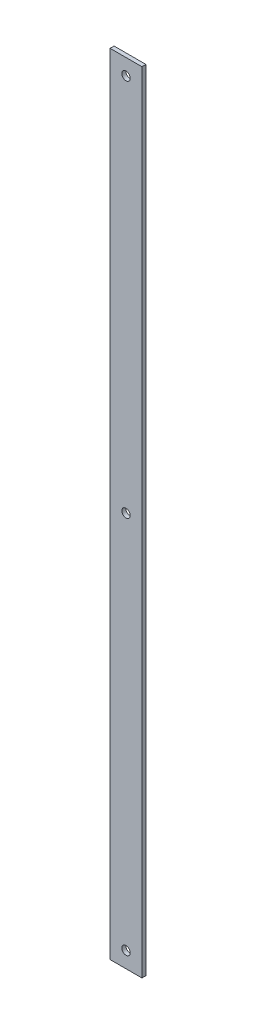
ISO-10303-21;
HEADER;
FILE_DESCRIPTION(('STEP AP214'),'2;1');
FILE_NAME('part.step','',(''),(''),'','','');
FILE_SCHEMA(('AUTOMOTIVE_DESIGN { 1 0 10303 214 1 1 1 1 }'));
ENDSEC;
DATA;
#1=APPLICATION_CONTEXT('core data for automotive mechanical design processes');
#2=APPLICATION_PROTOCOL_DEFINITION('international standard','automotive_design',2000,#1);
#3=PRODUCT_CONTEXT('',#1,'mechanical');
#4=PRODUCT('Part','Part','',(#3));
#5=PRODUCT_RELATED_PRODUCT_CATEGORY('part','',(#4));
#6=PRODUCT_DEFINITION_FORMATION('','',#4);
#7=PRODUCT_DEFINITION_CONTEXT('part definition',#1,'design');
#8=PRODUCT_DEFINITION('design','',#6,#7);
#9=PRODUCT_DEFINITION_SHAPE('','',#8);
#10=(LENGTH_UNIT() NAMED_UNIT(*) SI_UNIT(.MILLI.,.METRE.));
#11=(NAMED_UNIT(*) PLANE_ANGLE_UNIT() SI_UNIT($,.RADIAN.));
#12=(NAMED_UNIT(*) SI_UNIT($,.STERADIAN.) SOLID_ANGLE_UNIT());
#13=UNCERTAINTY_MEASURE_WITH_UNIT(LENGTH_MEASURE(1.E-05),#10,'distance_accuracy_value','');
#14=(GEOMETRIC_REPRESENTATION_CONTEXT(3) GLOBAL_UNCERTAINTY_ASSIGNED_CONTEXT((#13)) GLOBAL_UNIT_ASSIGNED_CONTEXT((#10,
#11,#12)) REPRESENTATION_CONTEXT('',''));
#15=CARTESIAN_POINT('',(0.,0.,0.));
#16=DIRECTION('',(0.,0.,1.));
#17=DIRECTION('',(1.,0.,0.));
#18=AXIS2_PLACEMENT_3D('',#15,#16,#17);
#19=CARTESIAN_POINT('',(-12.7,615.95,0.));
#20=DIRECTION('',(0.,0.,1.));
#21=DIRECTION('',(1.,0.,0.));
#22=AXIS2_PLACEMENT_3D('',#19,#20,#21);
#23=CYLINDRICAL_SURFACE('',#22,3.3655);
#24=CARTESIAN_POINT('',(-12.7,615.95,0.));
#25=DIRECTION('',(0.,0.,1.));
#26=DIRECTION('',(1.,0.,0.));
#27=AXIS2_PLACEMENT_3D('',#24,#25,#26);
#28=CIRCLE('',#27,3.3655);
#29=CARTESIAN_POINT('',(-9.33449999999996,615.95,0.));
#30=VERTEX_POINT('',#29);
#31=EDGE_CURVE('E45',#30,#30,#28,.T.);
#32=ORIENTED_EDGE('',*,*,#31,.F.);
#33=EDGE_LOOP('',(#32));
#34=FACE_BOUND('',#33,.T.);
#35=CARTESIAN_POINT('',(-12.7,615.95,3.175));
#36=DIRECTION('',(0.,0.,1.));
#37=DIRECTION('',(1.,0.,0.));
#38=AXIS2_PLACEMENT_3D('',#35,#36,#37);
#39=CIRCLE('',#38,3.3655);
#40=CARTESIAN_POINT('',(-9.33449999999996,615.95,3.175));
#41=VERTEX_POINT('',#40);
#42=EDGE_CURVE('E11',#41,#41,#39,.T.);
#43=ORIENTED_EDGE('',*,*,#42,.T.);
#44=EDGE_LOOP('',(#43));
#45=FACE_BOUND('',#44,.T.);
#46=ADVANCED_FACE('F37',(#34,#45),#23,.F.);
#47=CARTESIAN_POINT('',(0.,0.,3.175));
#48=DIRECTION('',(-1.,0.,0.));
#49=DIRECTION('',(0.,-1.,0.));
#50=AXIS2_PLACEMENT_3D('',#47,#48,#49);
#51=PLANE('',#50);
#52=DIRECTION('',(0.,1.,0.));
#53=VECTOR('',#52,1.);
#54=CARTESIAN_POINT('',(0.,0.,0.));
#55=LINE('',#54,#53);
#56=CARTESIAN_POINT('',(0.,0.,0.));
#57=VERTEX_POINT('',#56);
#58=CARTESIAN_POINT('',(0.,628.65,0.));
#59=VERTEX_POINT('',#58);
#60=EDGE_CURVE('E105',#57,#59,#55,.T.);
#61=ORIENTED_EDGE('',*,*,#60,.T.);
#62=DIRECTION('',(0.,0.,-1.));
#63=VECTOR('',#62,1.);
#64=CARTESIAN_POINT('',(0.,628.65,3.175));
#65=LINE('',#64,#63);
#66=CARTESIAN_POINT('',(0.,628.65,3.175));
#67=VERTEX_POINT('',#66);
#68=EDGE_CURVE('E96',#67,#59,#65,.T.);
#69=ORIENTED_EDGE('',*,*,#68,.F.);
#70=DIRECTION('',(0.,1.,0.));
#71=VECTOR('',#70,1.);
#72=CARTESIAN_POINT('',(0.,0.,3.175));
#73=LINE('',#72,#71);
#74=CARTESIAN_POINT('',(0.,0.,3.175));
#75=VERTEX_POINT('',#74);
#76=EDGE_CURVE('E90',#75,#67,#73,.T.);
#77=ORIENTED_EDGE('',*,*,#76,.F.);
#78=DIRECTION('',(0.,0.,-1.));
#79=VECTOR('',#78,1.);
#80=CARTESIAN_POINT('',(0.,0.,3.175));
#81=LINE('',#80,#79);
#82=EDGE_CURVE('E101',#75,#57,#81,.T.);
#83=ORIENTED_EDGE('',*,*,#82,.T.);
#84=EDGE_LOOP('',(#61,#69,#77,#83));
#85=FACE_BOUND('',#84,.T.);
#86=ADVANCED_FACE('F121',(#85),#51,.F.);
#87=CARTESIAN_POINT('',(0.,628.65,3.175));
#88=DIRECTION('',(0.,-1.,0.));
#89=DIRECTION('',(0.,0.,-1.));
#90=AXIS2_PLACEMENT_3D('',#87,#88,#89);
#91=PLANE('',#90);
#92=DIRECTION('',(-1.,0.,0.));
#93=VECTOR('',#92,1.);
#94=CARTESIAN_POINT('',(0.,628.65,0.));
#95=LINE('',#94,#93);
#96=CARTESIAN_POINT('',(-25.4,628.65,0.));
#97=VERTEX_POINT('',#96);
#98=EDGE_CURVE('E95',#59,#97,#95,.T.);
#99=ORIENTED_EDGE('',*,*,#98,.T.);
#100=DIRECTION('',(0.,0.,-1.));
#101=VECTOR('',#100,1.);
#102=CARTESIAN_POINT('',(-25.4,628.65,3.175));
#103=LINE('',#102,#101);
#104=CARTESIAN_POINT('',(-25.4,628.65,3.175));
#105=VERTEX_POINT('',#104);
#106=EDGE_CURVE('E93',#105,#97,#103,.T.);
#107=ORIENTED_EDGE('',*,*,#106,.F.);
#108=DIRECTION('',(-1.,0.,0.));
#109=VECTOR('',#108,1.);
#110=CARTESIAN_POINT('',(0.,628.65,3.175));
#111=LINE('',#110,#109);
#112=EDGE_CURVE('E84',#67,#105,#111,.T.);
#113=ORIENTED_EDGE('',*,*,#112,.F.);
#114=ORIENTED_EDGE('',*,*,#68,.T.);
#115=EDGE_LOOP('',(#99,#107,#113,#114));
#116=FACE_BOUND('',#115,.T.);
#117=ADVANCED_FACE('F94',(#116),#91,.F.);
#118=CARTESIAN_POINT('',(-25.4,0.,3.175));
#119=DIRECTION('',(1.,0.,0.));
#120=DIRECTION('',(0.,1.,0.));
#121=AXIS2_PLACEMENT_3D('',#118,#119,#120);
#122=PLANE('',#121);
#123=DIRECTION('',(0.,-1.,0.));
#124=VECTOR('',#123,1.);
#125=CARTESIAN_POINT('',(-25.4,0.,0.));
#126=LINE('',#125,#124);
#127=CARTESIAN_POINT('',(-25.4,0.,0.));
#128=VERTEX_POINT('',#127);
#129=EDGE_CURVE('E70',#97,#128,#126,.T.);
#130=ORIENTED_EDGE('',*,*,#129,.T.);
#131=DIRECTION('',(0.,0.,-1.));
#132=VECTOR('',#131,1.);
#133=CARTESIAN_POINT('',(-25.4,0.,3.175));
#134=LINE('',#133,#132);
#135=CARTESIAN_POINT('',(-25.4,0.,3.175));
#136=VERTEX_POINT('',#135);
#137=EDGE_CURVE('E97',#136,#128,#134,.T.);
#138=ORIENTED_EDGE('',*,*,#137,.F.);
#139=DIRECTION('',(0.,-1.,0.));
#140=VECTOR('',#139,1.);
#141=CARTESIAN_POINT('',(-25.4,0.,3.175));
#142=LINE('',#141,#140);
#143=EDGE_CURVE('E88',#105,#136,#142,.T.);
#144=ORIENTED_EDGE('',*,*,#143,.F.);
#145=ORIENTED_EDGE('',*,*,#106,.T.);
#146=EDGE_LOOP('',(#130,#138,#144,#145));
#147=FACE_BOUND('',#146,.T.);
#148=ADVANCED_FACE('F99',(#147),#122,.F.);
#149=CARTESIAN_POINT('',(0.,0.,3.175));
#150=DIRECTION('',(0.,1.,0.));
#151=DIRECTION('',(-1.,0.,0.));
#152=AXIS2_PLACEMENT_3D('',#149,#150,#151);
#153=PLANE('',#152);
#154=DIRECTION('',(1.,0.,0.));
#155=VECTOR('',#154,1.);
#156=CARTESIAN_POINT('',(0.,0.,0.));
#157=LINE('',#156,#155);
#158=EDGE_CURVE('E76',#128,#57,#157,.T.);
#159=ORIENTED_EDGE('',*,*,#158,.T.);
#160=ORIENTED_EDGE('',*,*,#82,.F.);
#161=DIRECTION('',(1.,0.,0.));
#162=VECTOR('',#161,1.);
#163=CARTESIAN_POINT('',(0.,0.,3.175));
#164=LINE('',#163,#162);
#165=EDGE_CURVE('E53',#136,#75,#164,.T.);
#166=ORIENTED_EDGE('',*,*,#165,.F.);
#167=ORIENTED_EDGE('',*,*,#137,.T.);
#168=EDGE_LOOP('',(#159,#160,#166,#167));
#169=FACE_BOUND('',#168,.T.);
#170=ADVANCED_FACE('F124',(#169),#153,.F.);
#171=CARTESIAN_POINT('',(0.,0.,3.175));
#172=DIRECTION('',(0.,0.,1.));
#173=DIRECTION('',(1.,0.,0.));
#174=AXIS2_PLACEMENT_3D('',#171,#172,#173);
#175=PLANE('',#174);
#176=CARTESIAN_POINT('',(-12.7,314.325,3.175));
#177=DIRECTION('',(0.,0.,1.));
#178=DIRECTION('',(1.,0.,0.));
#179=AXIS2_PLACEMENT_3D('',#176,#177,#178);
#180=CIRCLE('',#179,3.3655);
#181=CARTESIAN_POINT('',(-9.33449999999996,314.325,3.175));
#182=VERTEX_POINT('',#181);
#183=EDGE_CURVE('E153',#182,#182,#180,.T.);
#184=ORIENTED_EDGE('',*,*,#183,.F.);
#185=EDGE_LOOP('',(#184));
#186=FACE_BOUND('',#185,.T.);
#187=CARTESIAN_POINT('',(-12.7,12.7,3.175));
#188=DIRECTION('',(0.,0.,1.));
#189=DIRECTION('',(1.,0.,0.));
#190=AXIS2_PLACEMENT_3D('',#187,#188,#189);
#191=CIRCLE('',#190,3.3655);
#192=CARTESIAN_POINT('',(-9.33449999999996,12.7,3.175));
#193=VERTEX_POINT('',#192);
#194=EDGE_CURVE('E150',#193,#193,#191,.T.);
#195=ORIENTED_EDGE('',*,*,#194,.F.);
#196=EDGE_LOOP('',(#195));
#197=FACE_BOUND('',#196,.T.);
#198=ORIENTED_EDGE('',*,*,#76,.T.);
#199=ORIENTED_EDGE('',*,*,#112,.T.);
#200=ORIENTED_EDGE('',*,*,#143,.T.);
#201=ORIENTED_EDGE('',*,*,#165,.T.);
#202=EDGE_LOOP('',(#198,#199,#200,#201));
#203=FACE_BOUND('',#202,.T.);
#204=ORIENTED_EDGE('',*,*,#42,.F.);
#205=EDGE_LOOP('',(#204));
#206=FACE_BOUND('',#205,.T.);
#207=ADVANCED_FACE('F85',(#186,#197,#203,#206),#175,.T.);
#208=CARTESIAN_POINT('',(0.,0.,0.));
#209=DIRECTION('',(0.,0.,1.));
#210=DIRECTION('',(1.,0.,0.));
#211=AXIS2_PLACEMENT_3D('',#208,#209,#210);
#212=PLANE('',#211);
#213=CARTESIAN_POINT('',(-12.7,314.325,0.));
#214=DIRECTION('',(0.,0.,1.));
#215=DIRECTION('',(1.,0.,0.));
#216=AXIS2_PLACEMENT_3D('',#213,#214,#215);
#217=CIRCLE('',#216,3.3655);
#218=CARTESIAN_POINT('',(-9.33449999999996,314.325,0.));
#219=VERTEX_POINT('',#218);
#220=EDGE_CURVE('E158',#219,#219,#217,.T.);
#221=ORIENTED_EDGE('',*,*,#220,.T.);
#222=EDGE_LOOP('',(#221));
#223=FACE_BOUND('',#222,.T.);
#224=CARTESIAN_POINT('',(-12.7,12.7,0.));
#225=DIRECTION('',(0.,0.,1.));
#226=DIRECTION('',(1.,0.,0.));
#227=AXIS2_PLACEMENT_3D('',#224,#225,#226);
#228=CIRCLE('',#227,3.3655);
#229=CARTESIAN_POINT('',(-9.33449999999996,12.7,0.));
#230=VERTEX_POINT('',#229);
#231=EDGE_CURVE('E108',#230,#230,#228,.T.);
#232=ORIENTED_EDGE('',*,*,#231,.T.);
#233=EDGE_LOOP('',(#232));
#234=FACE_BOUND('',#233,.T.);
#235=ORIENTED_EDGE('',*,*,#60,.F.);
#236=ORIENTED_EDGE('',*,*,#158,.F.);
#237=ORIENTED_EDGE('',*,*,#129,.F.);
#238=ORIENTED_EDGE('',*,*,#98,.F.);
#239=EDGE_LOOP('',(#235,#236,#237,#238));
#240=FACE_BOUND('',#239,.T.);
#241=ORIENTED_EDGE('',*,*,#31,.T.);
#242=EDGE_LOOP('',(#241));
#243=FACE_BOUND('',#242,.T.);
#244=ADVANCED_FACE('F117',(#223,#234,#240,#243),#212,.F.);
#245=CARTESIAN_POINT('',(-12.7,12.7,0.));
#246=DIRECTION('',(0.,0.,1.));
#247=DIRECTION('',(1.,0.,0.));
#248=AXIS2_PLACEMENT_3D('',#245,#246,#247);
#249=CYLINDRICAL_SURFACE('',#248,3.3655);
#250=ORIENTED_EDGE('',*,*,#231,.F.);
#251=EDGE_LOOP('',(#250));
#252=FACE_BOUND('',#251,.T.);
#253=ORIENTED_EDGE('',*,*,#194,.T.);
#254=EDGE_LOOP('',(#253));
#255=FACE_BOUND('',#254,.T.);
#256=ADVANCED_FACE('F131',(#252,#255),#249,.F.);
#257=CARTESIAN_POINT('',(-12.7,314.325,0.));
#258=DIRECTION('',(0.,0.,1.));
#259=DIRECTION('',(1.,0.,0.));
#260=AXIS2_PLACEMENT_3D('',#257,#258,#259);
#261=CYLINDRICAL_SURFACE('',#260,3.3655);
#262=ORIENTED_EDGE('',*,*,#220,.F.);
#263=EDGE_LOOP('',(#262));
#264=FACE_BOUND('',#263,.T.);
#265=ORIENTED_EDGE('',*,*,#183,.T.);
#266=EDGE_LOOP('',(#265));
#267=FACE_BOUND('',#266,.T.);
#268=ADVANCED_FACE('F163',(#264,#267),#261,.F.);
#269=CLOSED_SHELL('',(#46,#86,#117,#148,#170,#207,#244,#256,#268));
#270=MANIFOLD_SOLID_BREP('B2',#269);
#271=ADVANCED_BREP_SHAPE_REPRESENTATION('',(#18,#270),#14);
#272=SHAPE_DEFINITION_REPRESENTATION(#9,#271);
ENDSEC;
END-ISO-10303-21;
